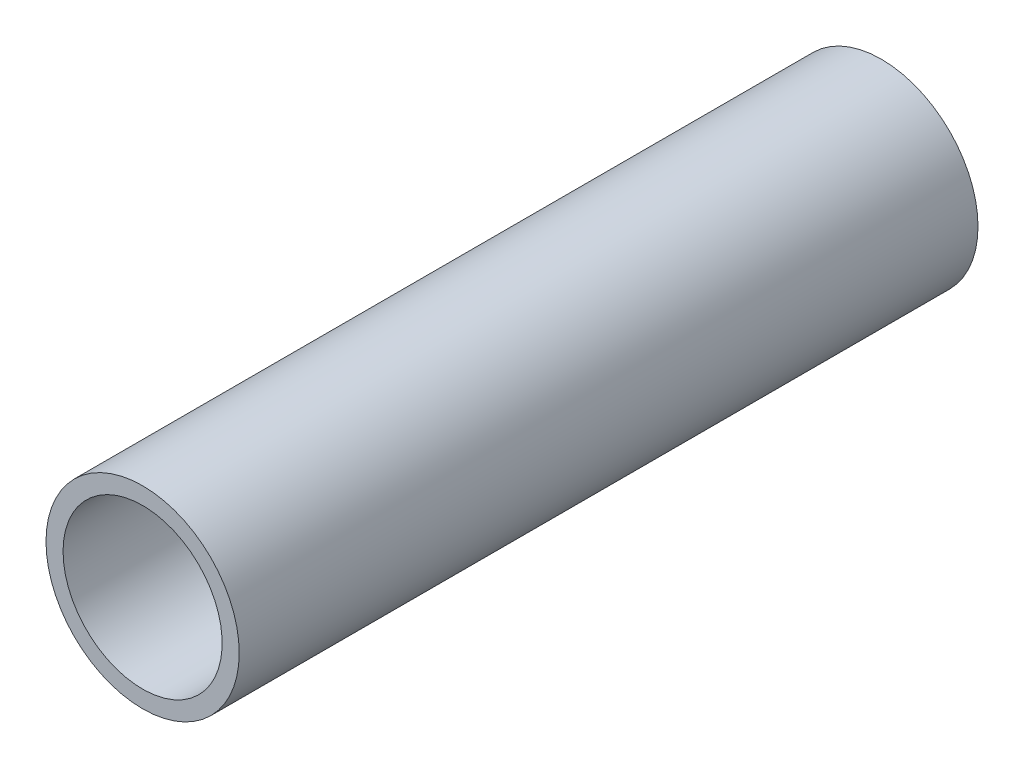
ISO-10303-21;
HEADER;
FILE_DESCRIPTION(('STEP AP214'),'2;1');
FILE_NAME('part.step','',(''),(''),'','','');
FILE_SCHEMA(('AUTOMOTIVE_DESIGN { 1 0 10303 214 1 1 1 1 }'));
ENDSEC;
DATA;
#1=APPLICATION_CONTEXT('core data for automotive mechanical design processes');
#2=APPLICATION_PROTOCOL_DEFINITION('international standard','automotive_design',2000,#1);
#3=PRODUCT_CONTEXT('',#1,'mechanical');
#4=PRODUCT('Part','Part','',(#3));
#5=PRODUCT_RELATED_PRODUCT_CATEGORY('part','',(#4));
#6=PRODUCT_DEFINITION_FORMATION('','',#4);
#7=PRODUCT_DEFINITION_CONTEXT('part definition',#1,'design');
#8=PRODUCT_DEFINITION('design','',#6,#7);
#9=PRODUCT_DEFINITION_SHAPE('','',#8);
#10=(LENGTH_UNIT() NAMED_UNIT(*) SI_UNIT(.MILLI.,.METRE.));
#11=(NAMED_UNIT(*) PLANE_ANGLE_UNIT() SI_UNIT($,.RADIAN.));
#12=(NAMED_UNIT(*) SI_UNIT($,.STERADIAN.) SOLID_ANGLE_UNIT());
#13=UNCERTAINTY_MEASURE_WITH_UNIT(LENGTH_MEASURE(1.E-05),#10,'distance_accuracy_value','');
#14=(GEOMETRIC_REPRESENTATION_CONTEXT(3) GLOBAL_UNCERTAINTY_ASSIGNED_CONTEXT((#13)) GLOBAL_UNIT_ASSIGNED_CONTEXT((#10,
#11,#12)) REPRESENTATION_CONTEXT('',''));
#15=CARTESIAN_POINT('',(0.,0.,0.));
#16=DIRECTION('',(0.,0.,1.));
#17=DIRECTION('',(1.,0.,0.));
#18=AXIS2_PLACEMENT_3D('',#15,#16,#17);
#19=CARTESIAN_POINT('',(347.5,-25.9999999999994,108.083261120685));
#20=DIRECTION('',(0.,0.,-1.));
#21=DIRECTION('',(-1.,0.,0.));
#22=AXIS2_PLACEMENT_3D('',#19,#20,#21);
#23=CYLINDRICAL_SURFACE('',#22,14.);
#24=CARTESIAN_POINT('',(347.5,-25.9999999999994,39.9999999999999));
#25=DIRECTION('',(0.,0.,-1.));
#26=DIRECTION('',(-1.,0.,0.));
#27=AXIS2_PLACEMENT_3D('',#24,#25,#26);
#28=CIRCLE('',#27,14.);
#29=CARTESIAN_POINT('',(333.5,-25.9999999999994,39.9999999999999));
#30=VERTEX_POINT('',#29);
#31=EDGE_CURVE('E17',#30,#30,#28,.F.);
#32=ORIENTED_EDGE('',*,*,#31,.T.);
#33=EDGE_LOOP('',(#32));
#34=FACE_BOUND('',#33,.T.);
#35=CARTESIAN_POINT('',(347.5,-25.9999999999994,-90.0000000000001));
#36=DIRECTION('',(0.,0.,-1.));
#37=DIRECTION('',(-1.,0.,0.));
#38=AXIS2_PLACEMENT_3D('',#35,#36,#37);
#39=CIRCLE('',#38,14.);
#40=CARTESIAN_POINT('',(333.5,-25.9999999999994,-90.0000000000001));
#41=VERTEX_POINT('',#40);
#42=EDGE_CURVE('E26',#41,#41,#39,.F.);
#43=ORIENTED_EDGE('',*,*,#42,.F.);
#44=EDGE_LOOP('',(#43));
#45=FACE_BOUND('',#44,.T.);
#46=ADVANCED_FACE('F14',(#34,#45),#23,.F.);
#47=CARTESIAN_POINT('',(0.,665.,40.));
#48=DIRECTION('',(0.,0.,-1.));
#49=DIRECTION('',(-1.,0.,0.));
#50=AXIS2_PLACEMENT_3D('',#47,#48,#49);
#51=PLANE('',#50);
#52=CARTESIAN_POINT('',(347.5,-25.9999999999994,39.9999999999999));
#53=DIRECTION('',(0.,0.,-1.));
#54=DIRECTION('',(-1.,0.,0.));
#55=AXIS2_PLACEMENT_3D('',#52,#53,#54);
#56=CIRCLE('',#55,17.);
#57=CARTESIAN_POINT('',(330.5,-25.9999999999994,39.9999999999999));
#58=VERTEX_POINT('',#57);
#59=EDGE_CURVE('E21',#58,#58,#56,.T.);
#60=ORIENTED_EDGE('',*,*,#59,.F.);
#61=EDGE_LOOP('',(#60));
#62=FACE_BOUND('',#61,.T.);
#63=ORIENTED_EDGE('',*,*,#31,.F.);
#64=EDGE_LOOP('',(#63));
#65=FACE_BOUND('',#64,.T.);
#66=ADVANCED_FACE('F36',(#62,#65),#51,.F.);
#67=CARTESIAN_POINT('',(0.,665.,-90.));
#68=DIRECTION('',(0.,0.,-1.));
#69=DIRECTION('',(-1.,0.,0.));
#70=AXIS2_PLACEMENT_3D('',#67,#68,#69);
#71=PLANE('',#70);
#72=ORIENTED_EDGE('',*,*,#42,.T.);
#73=EDGE_LOOP('',(#72));
#74=FACE_BOUND('',#73,.T.);
#75=CARTESIAN_POINT('',(347.5,-25.9999999999994,-90.0000000000001));
#76=DIRECTION('',(0.,0.,-1.));
#77=DIRECTION('',(-1.,0.,0.));
#78=AXIS2_PLACEMENT_3D('',#75,#76,#77);
#79=CIRCLE('',#78,17.);
#80=CARTESIAN_POINT('',(330.5,-25.9999999999994,-90.0000000000001));
#81=VERTEX_POINT('',#80);
#82=EDGE_CURVE('E10',#81,#81,#79,.F.);
#83=ORIENTED_EDGE('',*,*,#82,.F.);
#84=EDGE_LOOP('',(#83));
#85=FACE_BOUND('',#84,.T.);
#86=ADVANCED_FACE('F38',(#74,#85),#71,.T.);
#87=CARTESIAN_POINT('',(347.5,-25.9999999999994,108.083261120685));
#88=DIRECTION('',(0.,0.,-1.));
#89=DIRECTION('',(-1.,0.,0.));
#90=AXIS2_PLACEMENT_3D('',#87,#88,#89);
#91=CYLINDRICAL_SURFACE('',#90,17.);
#92=ORIENTED_EDGE('',*,*,#82,.T.);
#93=EDGE_LOOP('',(#92));
#94=FACE_BOUND('',#93,.T.);
#95=ORIENTED_EDGE('',*,*,#59,.T.);
#96=EDGE_LOOP('',(#95));
#97=FACE_BOUND('',#96,.T.);
#98=ADVANCED_FACE('F45',(#94,#97),#91,.T.);
#99=CLOSED_SHELL('',(#46,#66,#86,#98));
#100=MANIFOLD_SOLID_BREP('B1',#99);
#101=ADVANCED_BREP_SHAPE_REPRESENTATION('',(#18,#100),#14);
#102=SHAPE_DEFINITION_REPRESENTATION(#9,#101);
ENDSEC;
END-ISO-10303-21;
